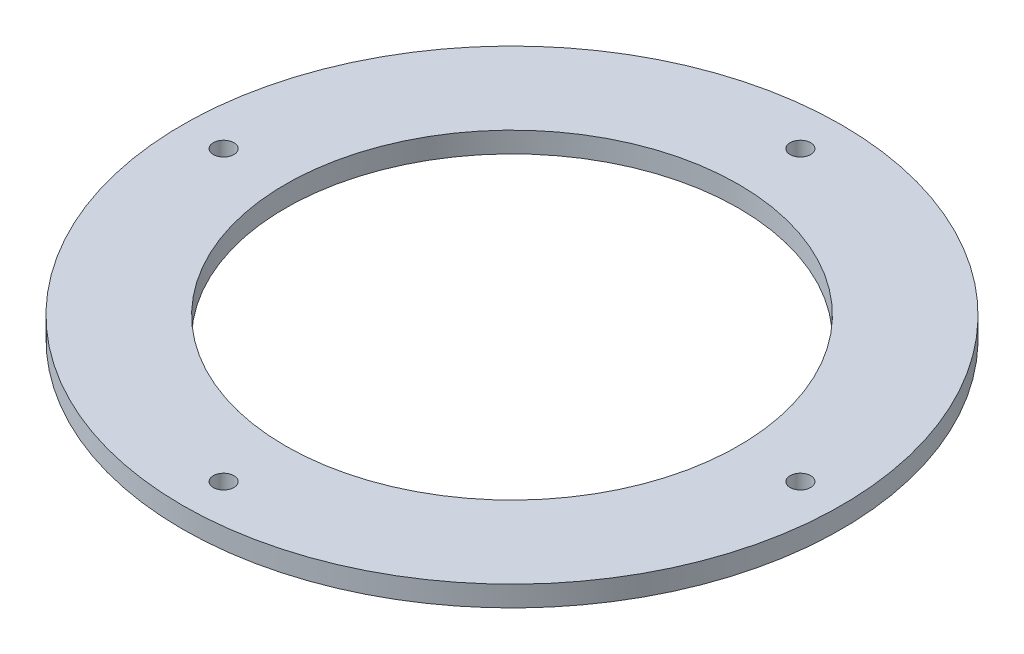
ISO-10303-21;
HEADER;
FILE_DESCRIPTION(('STEP AP214'),'2;1');
FILE_NAME('part.step','',(''),(''),'','','');
FILE_SCHEMA(('AUTOMOTIVE_DESIGN { 1 0 10303 214 1 1 1 1 }'));
ENDSEC;
DATA;
#1=APPLICATION_CONTEXT('core data for automotive mechanical design processes');
#2=APPLICATION_PROTOCOL_DEFINITION('international standard','automotive_design',2000,#1);
#3=PRODUCT_CONTEXT('',#1,'mechanical');
#4=PRODUCT('Part','Part','',(#3));
#5=PRODUCT_RELATED_PRODUCT_CATEGORY('part','',(#4));
#6=PRODUCT_DEFINITION_FORMATION('','',#4);
#7=PRODUCT_DEFINITION_CONTEXT('part definition',#1,'design');
#8=PRODUCT_DEFINITION('design','',#6,#7);
#9=PRODUCT_DEFINITION_SHAPE('','',#8);
#10=(LENGTH_UNIT() NAMED_UNIT(*) SI_UNIT(.MILLI.,.METRE.));
#11=(NAMED_UNIT(*) PLANE_ANGLE_UNIT() SI_UNIT($,.RADIAN.));
#12=(NAMED_UNIT(*) SI_UNIT($,.STERADIAN.) SOLID_ANGLE_UNIT());
#13=UNCERTAINTY_MEASURE_WITH_UNIT(LENGTH_MEASURE(1.E-05),#10,'distance_accuracy_value','');
#14=(GEOMETRIC_REPRESENTATION_CONTEXT(3) GLOBAL_UNCERTAINTY_ASSIGNED_CONTEXT((#13)) GLOBAL_UNIT_ASSIGNED_CONTEXT((#10,
#11,#12)) REPRESENTATION_CONTEXT('',''));
#15=CARTESIAN_POINT('',(0.,0.,0.));
#16=DIRECTION('',(0.,0.,1.));
#17=DIRECTION('',(1.,0.,0.));
#18=AXIS2_PLACEMENT_3D('',#15,#16,#17);
#19=CARTESIAN_POINT('',(0.,6.35,0.));
#20=DIRECTION('',(0.,1.,0.));
#21=DIRECTION('',(0.,0.,1.));
#22=AXIS2_PLACEMENT_3D('',#19,#20,#21);
#23=PLANE('',#22);
#24=CARTESIAN_POINT('',(-88.9,6.35,0.));
#25=DIRECTION('',(0.,1.,0.));
#26=DIRECTION('',(0.,0.,1.));
#27=AXIS2_PLACEMENT_3D('',#24,#25,#26);
#28=CIRCLE('',#27,3.175);
#29=CARTESIAN_POINT('',(-88.9,6.35,3.175));
#30=VERTEX_POINT('',#29);
#31=EDGE_CURVE('E68',#30,#30,#28,.T.);
#32=ORIENTED_EDGE('',*,*,#31,.F.);
#33=EDGE_LOOP('',(#32));
#34=FACE_BOUND('',#33,.T.);
#35=CARTESIAN_POINT('',(0.,6.35,88.9));
#36=DIRECTION('',(0.,1.,0.));
#37=DIRECTION('',(0.,0.,1.));
#38=AXIS2_PLACEMENT_3D('',#35,#36,#37);
#39=CIRCLE('',#38,3.175);
#40=CARTESIAN_POINT('',(0.,6.35,92.075));
#41=VERTEX_POINT('',#40);
#42=EDGE_CURVE('E62',#41,#41,#39,.T.);
#43=ORIENTED_EDGE('',*,*,#42,.F.);
#44=EDGE_LOOP('',(#43));
#45=FACE_BOUND('',#44,.T.);
#46=CARTESIAN_POINT('',(88.9,6.35,0.));
#47=DIRECTION('',(0.,1.,0.));
#48=DIRECTION('',(0.,0.,1.));
#49=AXIS2_PLACEMENT_3D('',#46,#47,#48);
#50=CIRCLE('',#49,3.175);
#51=CARTESIAN_POINT('',(88.9,6.35,3.175));
#52=VERTEX_POINT('',#51);
#53=EDGE_CURVE('E56',#52,#52,#50,.T.);
#54=ORIENTED_EDGE('',*,*,#53,.F.);
#55=EDGE_LOOP('',(#54));
#56=FACE_BOUND('',#55,.T.);
#57=CARTESIAN_POINT('',(0.,6.35,-88.9));
#58=DIRECTION('',(0.,1.,0.));
#59=DIRECTION('',(0.,0.,1.));
#60=AXIS2_PLACEMENT_3D('',#57,#58,#59);
#61=CIRCLE('',#60,3.175);
#62=CARTESIAN_POINT('',(0.,6.35,-85.725));
#63=VERTEX_POINT('',#62);
#64=EDGE_CURVE('E50',#63,#63,#61,.T.);
#65=ORIENTED_EDGE('',*,*,#64,.F.);
#66=EDGE_LOOP('',(#65));
#67=FACE_BOUND('',#66,.T.);
#68=CARTESIAN_POINT('',(0.,6.35,0.));
#69=DIRECTION('',(0.,1.,0.));
#70=DIRECTION('',(0.,0.,1.));
#71=AXIS2_PLACEMENT_3D('',#68,#69,#70);
#72=CIRCLE('',#71,101.6);
#73=CARTESIAN_POINT('',(0.,6.35,101.6));
#74=VERTEX_POINT('',#73);
#75=EDGE_CURVE('E10',#74,#74,#72,.T.);
#76=ORIENTED_EDGE('',*,*,#75,.T.);
#77=EDGE_LOOP('',(#76));
#78=FACE_BOUND('',#77,.T.);
#79=CARTESIAN_POINT('',(0.,6.35,0.));
#80=DIRECTION('',(0.,1.,0.));
#81=DIRECTION('',(0.,0.,1.));
#82=AXIS2_PLACEMENT_3D('',#79,#80,#81);
#83=CIRCLE('',#82,69.85);
#84=CARTESIAN_POINT('',(0.,6.35,69.85));
#85=VERTEX_POINT('',#84);
#86=EDGE_CURVE('E42',#85,#85,#83,.T.);
#87=ORIENTED_EDGE('',*,*,#86,.F.);
#88=EDGE_LOOP('',(#87));
#89=FACE_BOUND('',#88,.T.);
#90=ADVANCED_FACE('F31',(#34,#45,#56,#67,#78,#89),#23,.T.);
#91=CARTESIAN_POINT('',(0.,0.,0.));
#92=DIRECTION('',(0.,1.,0.));
#93=DIRECTION('',(0.,0.,1.));
#94=AXIS2_PLACEMENT_3D('',#91,#92,#93);
#95=PLANE('',#94);
#96=CARTESIAN_POINT('',(-88.9,0.,0.));
#97=DIRECTION('',(0.,1.,0.));
#98=DIRECTION('',(0.,0.,1.));
#99=AXIS2_PLACEMENT_3D('',#96,#97,#98);
#100=CIRCLE('',#99,3.175);
#101=CARTESIAN_POINT('',(-88.9,0.,3.175));
#102=VERTEX_POINT('',#101);
#103=EDGE_CURVE('E65',#102,#102,#100,.T.);
#104=ORIENTED_EDGE('',*,*,#103,.T.);
#105=EDGE_LOOP('',(#104));
#106=FACE_BOUND('',#105,.T.);
#107=CARTESIAN_POINT('',(0.,0.,88.9));
#108=DIRECTION('',(0.,1.,0.));
#109=DIRECTION('',(0.,0.,1.));
#110=AXIS2_PLACEMENT_3D('',#107,#108,#109);
#111=CIRCLE('',#110,3.175);
#112=CARTESIAN_POINT('',(0.,0.,92.075));
#113=VERTEX_POINT('',#112);
#114=EDGE_CURVE('E59',#113,#113,#111,.T.);
#115=ORIENTED_EDGE('',*,*,#114,.T.);
#116=EDGE_LOOP('',(#115));
#117=FACE_BOUND('',#116,.T.);
#118=CARTESIAN_POINT('',(88.9,0.,0.));
#119=DIRECTION('',(0.,1.,0.));
#120=DIRECTION('',(0.,0.,1.));
#121=AXIS2_PLACEMENT_3D('',#118,#119,#120);
#122=CIRCLE('',#121,3.175);
#123=CARTESIAN_POINT('',(88.9,0.,3.175));
#124=VERTEX_POINT('',#123);
#125=EDGE_CURVE('E53',#124,#124,#122,.T.);
#126=ORIENTED_EDGE('',*,*,#125,.T.);
#127=EDGE_LOOP('',(#126));
#128=FACE_BOUND('',#127,.T.);
#129=CARTESIAN_POINT('',(0.,0.,-88.9));
#130=DIRECTION('',(0.,1.,0.));
#131=DIRECTION('',(0.,0.,1.));
#132=AXIS2_PLACEMENT_3D('',#129,#130,#131);
#133=CIRCLE('',#132,3.175);
#134=CARTESIAN_POINT('',(0.,0.,-85.725));
#135=VERTEX_POINT('',#134);
#136=EDGE_CURVE('E47',#135,#135,#133,.T.);
#137=ORIENTED_EDGE('',*,*,#136,.T.);
#138=EDGE_LOOP('',(#137));
#139=FACE_BOUND('',#138,.T.);
#140=CARTESIAN_POINT('',(0.,0.,0.));
#141=DIRECTION('',(0.,1.,0.));
#142=DIRECTION('',(0.,0.,1.));
#143=AXIS2_PLACEMENT_3D('',#140,#141,#142);
#144=CIRCLE('',#143,101.6);
#145=CARTESIAN_POINT('',(0.,0.,101.6));
#146=VERTEX_POINT('',#145);
#147=EDGE_CURVE('E35',#146,#146,#144,.T.);
#148=ORIENTED_EDGE('',*,*,#147,.F.);
#149=EDGE_LOOP('',(#148));
#150=FACE_BOUND('',#149,.T.);
#151=CARTESIAN_POINT('',(0.,0.,0.));
#152=DIRECTION('',(0.,1.,0.));
#153=DIRECTION('',(0.,0.,1.));
#154=AXIS2_PLACEMENT_3D('',#151,#152,#153);
#155=CIRCLE('',#154,69.85);
#156=CARTESIAN_POINT('',(0.,0.,69.85));
#157=VERTEX_POINT('',#156);
#158=EDGE_CURVE('E44',#157,#157,#155,.T.);
#159=ORIENTED_EDGE('',*,*,#158,.T.);
#160=EDGE_LOOP('',(#159));
#161=FACE_BOUND('',#160,.T.);
#162=ADVANCED_FACE('F74',(#106,#117,#128,#139,#150,#161),#95,.F.);
#163=CARTESIAN_POINT('',(0.,6.35,0.));
#164=DIRECTION('',(0.,-1.,0.));
#165=DIRECTION('',(0.,0.,-1.));
#166=AXIS2_PLACEMENT_3D('',#163,#164,#165);
#167=CYLINDRICAL_SURFACE('',#166,101.6);
#168=ORIENTED_EDGE('',*,*,#75,.F.);
#169=EDGE_LOOP('',(#168));
#170=FACE_BOUND('',#169,.T.);
#171=ORIENTED_EDGE('',*,*,#147,.T.);
#172=EDGE_LOOP('',(#171));
#173=FACE_BOUND('',#172,.T.);
#174=ADVANCED_FACE('F33',(#170,#173),#167,.T.);
#175=CARTESIAN_POINT('',(0.,6.35,0.));
#176=DIRECTION('',(0.,-1.,0.));
#177=DIRECTION('',(0.,0.,-1.));
#178=AXIS2_PLACEMENT_3D('',#175,#176,#177);
#179=CYLINDRICAL_SURFACE('',#178,69.85);
#180=ORIENTED_EDGE('',*,*,#86,.T.);
#181=EDGE_LOOP('',(#180));
#182=FACE_BOUND('',#181,.T.);
#183=ORIENTED_EDGE('',*,*,#158,.F.);
#184=EDGE_LOOP('',(#183));
#185=FACE_BOUND('',#184,.T.);
#186=ADVANCED_FACE('F95',(#182,#185),#179,.F.);
#187=CARTESIAN_POINT('',(0.,0.,-88.9));
#188=DIRECTION('',(0.,1.,0.));
#189=DIRECTION('',(0.,0.,1.));
#190=AXIS2_PLACEMENT_3D('',#187,#188,#189);
#191=CYLINDRICAL_SURFACE('',#190,3.175);
#192=ORIENTED_EDGE('',*,*,#136,.F.);
#193=EDGE_LOOP('',(#192));
#194=FACE_BOUND('',#193,.T.);
#195=ORIENTED_EDGE('',*,*,#64,.T.);
#196=EDGE_LOOP('',(#195));
#197=FACE_BOUND('',#196,.T.);
#198=ADVANCED_FACE('F98',(#194,#197),#191,.F.);
#199=CARTESIAN_POINT('',(88.9,0.,0.));
#200=DIRECTION('',(0.,1.,0.));
#201=DIRECTION('',(0.,0.,1.));
#202=AXIS2_PLACEMENT_3D('',#199,#200,#201);
#203=CYLINDRICAL_SURFACE('',#202,3.175);
#204=ORIENTED_EDGE('',*,*,#125,.F.);
#205=EDGE_LOOP('',(#204));
#206=FACE_BOUND('',#205,.T.);
#207=ORIENTED_EDGE('',*,*,#53,.T.);
#208=EDGE_LOOP('',(#207));
#209=FACE_BOUND('',#208,.T.);
#210=ADVANCED_FACE('F110',(#206,#209),#203,.F.);
#211=CARTESIAN_POINT('',(0.,0.,88.9));
#212=DIRECTION('',(0.,1.,0.));
#213=DIRECTION('',(0.,0.,1.));
#214=AXIS2_PLACEMENT_3D('',#211,#212,#213);
#215=CYLINDRICAL_SURFACE('',#214,3.175);
#216=ORIENTED_EDGE('',*,*,#114,.F.);
#217=EDGE_LOOP('',(#216));
#218=FACE_BOUND('',#217,.T.);
#219=ORIENTED_EDGE('',*,*,#42,.T.);
#220=EDGE_LOOP('',(#219));
#221=FACE_BOUND('',#220,.T.);
#222=ADVANCED_FACE('F80',(#218,#221),#215,.F.);
#223=CARTESIAN_POINT('',(-88.9,0.,0.));
#224=DIRECTION('',(0.,1.,0.));
#225=DIRECTION('',(0.,0.,1.));
#226=AXIS2_PLACEMENT_3D('',#223,#224,#225);
#227=CYLINDRICAL_SURFACE('',#226,3.175);
#228=ORIENTED_EDGE('',*,*,#103,.F.);
#229=EDGE_LOOP('',(#228));
#230=FACE_BOUND('',#229,.T.);
#231=ORIENTED_EDGE('',*,*,#31,.T.);
#232=EDGE_LOOP('',(#231));
#233=FACE_BOUND('',#232,.T.);
#234=ADVANCED_FACE('F77',(#230,#233),#227,.F.);
#235=CLOSED_SHELL('',(#90,#162,#174,#186,#198,#210,#222,#234));
#236=MANIFOLD_SOLID_BREP('B2',#235);
#237=ADVANCED_BREP_SHAPE_REPRESENTATION('',(#18,#236),#14);
#238=SHAPE_DEFINITION_REPRESENTATION(#9,#237);
ENDSEC;
END-ISO-10303-21;
